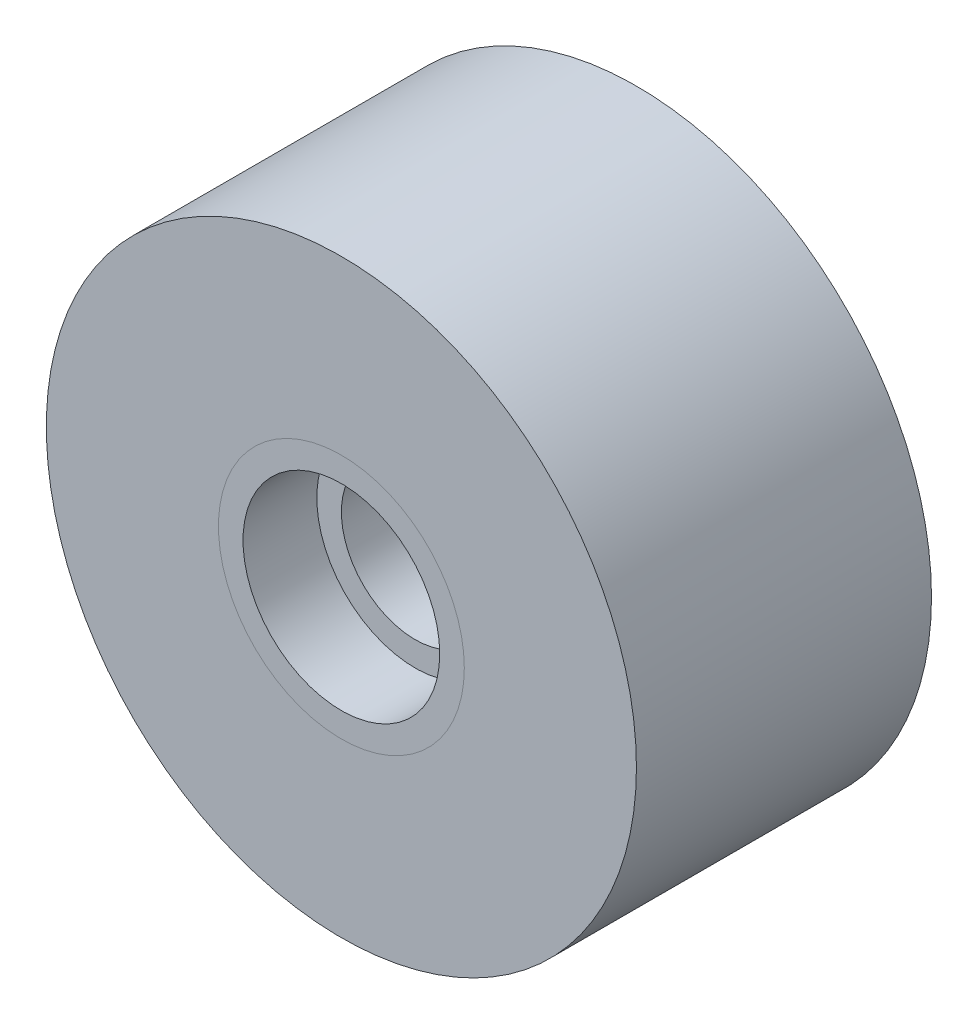
ISO-10303-21;
HEADER;
FILE_DESCRIPTION(('STEP AP214'),'2;1');
FILE_NAME('part.step','',(''),(''),'','','');
FILE_SCHEMA(('AUTOMOTIVE_DESIGN { 1 0 10303 214 1 1 1 1 }'));
ENDSEC;
DATA;
#1=APPLICATION_CONTEXT('core data for automotive mechanical design processes');
#2=APPLICATION_PROTOCOL_DEFINITION('international standard','automotive_design',2000,#1);
#3=PRODUCT_CONTEXT('',#1,'mechanical');
#4=PRODUCT('Part','Part','',(#3));
#5=PRODUCT_RELATED_PRODUCT_CATEGORY('part','',(#4));
#6=PRODUCT_DEFINITION_FORMATION('','',#4);
#7=PRODUCT_DEFINITION_CONTEXT('part definition',#1,'design');
#8=PRODUCT_DEFINITION('design','',#6,#7);
#9=PRODUCT_DEFINITION_SHAPE('','',#8);
#10=(LENGTH_UNIT() NAMED_UNIT(*) SI_UNIT(.MILLI.,.METRE.));
#11=(NAMED_UNIT(*) PLANE_ANGLE_UNIT() SI_UNIT($,.RADIAN.));
#12=(NAMED_UNIT(*) SI_UNIT($,.STERADIAN.) SOLID_ANGLE_UNIT());
#13=UNCERTAINTY_MEASURE_WITH_UNIT(LENGTH_MEASURE(1.E-05),#10,'distance_accuracy_value','');
#14=(GEOMETRIC_REPRESENTATION_CONTEXT(3) GLOBAL_UNCERTAINTY_ASSIGNED_CONTEXT((#13)) GLOBAL_UNIT_ASSIGNED_CONTEXT((#10,
#11,#12)) REPRESENTATION_CONTEXT('',''));
#15=CARTESIAN_POINT('',(0.,0.,0.));
#16=DIRECTION('',(0.,0.,1.));
#17=DIRECTION('',(1.,0.,0.));
#18=AXIS2_PLACEMENT_3D('',#15,#16,#17);
#19=CARTESIAN_POINT('',(0.,0.,6.));
#20=DIRECTION('',(0.,0.,-1.));
#21=DIRECTION('',(-1.,0.,0.));
#22=AXIS2_PLACEMENT_3D('',#19,#20,#21);
#23=CYLINDRICAL_SURFACE('',#22,4.);
#24=CARTESIAN_POINT('',(0.,0.,-6.));
#25=DIRECTION('',(0.,0.,1.));
#26=DIRECTION('',(1.,0.,0.));
#27=AXIS2_PLACEMENT_3D('',#24,#25,#26);
#28=CIRCLE('',#27,4.);
#29=CARTESIAN_POINT('',(4.,0.,-6.));
#30=VERTEX_POINT('',#29);
#31=EDGE_CURVE('E64',#30,#30,#28,.T.);
#32=ORIENTED_EDGE('',*,*,#31,.F.);
#33=EDGE_LOOP('',(#32));
#34=FACE_BOUND('',#33,.T.);
#35=CARTESIAN_POINT('',(0.,0.,-3.));
#36=DIRECTION('',(0.,0.,1.));
#37=DIRECTION('',(1.,0.,0.));
#38=AXIS2_PLACEMENT_3D('',#35,#36,#37);
#39=CIRCLE('',#38,4.);
#40=CARTESIAN_POINT('',(4.,0.,-3.));
#41=VERTEX_POINT('',#40);
#42=EDGE_CURVE('E97',#41,#41,#39,.T.);
#43=ORIENTED_EDGE('',*,*,#42,.T.);
#44=EDGE_LOOP('',(#43));
#45=FACE_BOUND('',#44,.T.);
#46=ADVANCED_FACE('F44',(#34,#45),#23,.F.);
#47=CARTESIAN_POINT('',(0.,0.,3.));
#48=DIRECTION('',(0.,0.,1.));
#49=DIRECTION('',(1.,0.,0.));
#50=AXIS2_PLACEMENT_3D('',#47,#48,#49);
#51=CIRCLE('',#50,4.);
#52=CARTESIAN_POINT('',(4.,0.,3.));
#53=VERTEX_POINT('',#52);
#54=EDGE_CURVE('E11',#53,#53,#51,.T.);
#55=ORIENTED_EDGE('',*,*,#54,.F.);
#56=EDGE_LOOP('',(#55));
#57=FACE_BOUND('',#56,.T.);
#58=CARTESIAN_POINT('',(0.,0.,6.));
#59=DIRECTION('',(0.,0.,1.));
#60=DIRECTION('',(1.,0.,0.));
#61=AXIS2_PLACEMENT_3D('',#58,#59,#60);
#62=CIRCLE('',#61,4.);
#63=CARTESIAN_POINT('',(4.,0.,6.));
#64=VERTEX_POINT('',#63);
#65=EDGE_CURVE('E55',#64,#64,#62,.T.);
#66=ORIENTED_EDGE('',*,*,#65,.T.);
#67=EDGE_LOOP('',(#66));
#68=FACE_BOUND('',#67,.T.);
#69=ADVANCED_FACE('F46',(#57,#68),#23,.F.);
#70=CARTESIAN_POINT('',(0.,0.,6.));
#71=DIRECTION('',(0.,0.,-1.));
#72=DIRECTION('',(-1.,0.,0.));
#73=AXIS2_PLACEMENT_3D('',#70,#71,#72);
#74=CYLINDRICAL_SURFACE('',#73,5.);
#75=CARTESIAN_POINT('',(0.,0.,6.));
#76=DIRECTION('',(0.,0.,1.));
#77=DIRECTION('',(1.,0.,0.));
#78=AXIS2_PLACEMENT_3D('',#75,#76,#77);
#79=CIRCLE('',#78,5.);
#80=CARTESIAN_POINT('',(5.,0.,6.));
#81=VERTEX_POINT('',#80);
#82=EDGE_CURVE('E51',#81,#81,#79,.T.);
#83=ORIENTED_EDGE('',*,*,#82,.F.);
#84=EDGE_LOOP('',(#83));
#85=FACE_BOUND('',#84,.T.);
#86=CARTESIAN_POINT('',(0.,0.,-6.));
#87=DIRECTION('',(0.,0.,1.));
#88=DIRECTION('',(1.,0.,0.));
#89=AXIS2_PLACEMENT_3D('',#86,#87,#88);
#90=CIRCLE('',#89,5.);
#91=CARTESIAN_POINT('',(5.,0.,-6.));
#92=VERTEX_POINT('',#91);
#93=EDGE_CURVE('E60',#92,#92,#90,.T.);
#94=ORIENTED_EDGE('',*,*,#93,.T.);
#95=EDGE_LOOP('',(#94));
#96=FACE_BOUND('',#95,.T.);
#97=ADVANCED_FACE('F70',(#85,#96),#74,.T.);
#98=CARTESIAN_POINT('',(0.,0.,6.));
#99=DIRECTION('',(0.,0.,1.));
#100=DIRECTION('',(1.,0.,0.));
#101=AXIS2_PLACEMENT_3D('',#98,#99,#100);
#102=PLANE('',#101);
#103=ORIENTED_EDGE('',*,*,#65,.F.);
#104=EDGE_LOOP('',(#103));
#105=FACE_BOUND('',#104,.T.);
#106=ORIENTED_EDGE('',*,*,#82,.T.);
#107=EDGE_LOOP('',(#106));
#108=FACE_BOUND('',#107,.T.);
#109=ADVANCED_FACE('F75',(#105,#108),#102,.T.);
#110=CARTESIAN_POINT('',(0.,0.,-6.));
#111=DIRECTION('',(0.,0.,1.));
#112=DIRECTION('',(1.,0.,0.));
#113=AXIS2_PLACEMENT_3D('',#110,#111,#112);
#114=PLANE('',#113);
#115=ORIENTED_EDGE('',*,*,#31,.T.);
#116=EDGE_LOOP('',(#115));
#117=FACE_BOUND('',#116,.T.);
#118=ORIENTED_EDGE('',*,*,#93,.F.);
#119=EDGE_LOOP('',(#118));
#120=FACE_BOUND('',#119,.T.);
#121=ADVANCED_FACE('F72',(#117,#120),#114,.F.);
#122=CARTESIAN_POINT('',(0.,0.,3.));
#123=DIRECTION('',(0.,0.,-1.));
#124=DIRECTION('',(-1.,0.,0.));
#125=AXIS2_PLACEMENT_3D('',#122,#123,#124);
#126=CYLINDRICAL_SURFACE('',#125,3.);
#127=CARTESIAN_POINT('',(0.,0.,3.));
#128=DIRECTION('',(0.,0.,1.));
#129=DIRECTION('',(1.,0.,0.));
#130=AXIS2_PLACEMENT_3D('',#127,#128,#129);
#131=CIRCLE('',#130,3.);
#132=CARTESIAN_POINT('',(3.,0.,3.));
#133=VERTEX_POINT('',#132);
#134=EDGE_CURVE('E66',#133,#133,#131,.T.);
#135=ORIENTED_EDGE('',*,*,#134,.T.);
#136=EDGE_LOOP('',(#135));
#137=FACE_BOUND('',#136,.T.);
#138=CARTESIAN_POINT('',(0.,0.,-3.));
#139=DIRECTION('',(0.,0.,1.));
#140=DIRECTION('',(1.,0.,0.));
#141=AXIS2_PLACEMENT_3D('',#138,#139,#140);
#142=CIRCLE('',#141,3.);
#143=CARTESIAN_POINT('',(3.,0.,-3.));
#144=VERTEX_POINT('',#143);
#145=EDGE_CURVE('E99',#144,#144,#142,.T.);
#146=ORIENTED_EDGE('',*,*,#145,.F.);
#147=EDGE_LOOP('',(#146));
#148=FACE_BOUND('',#147,.T.);
#149=ADVANCED_FACE('F74',(#137,#148),#126,.F.);
#150=CARTESIAN_POINT('',(0.,0.,3.));
#151=DIRECTION('',(0.,0.,1.));
#152=DIRECTION('',(1.,0.,0.));
#153=AXIS2_PLACEMENT_3D('',#150,#151,#152);
#154=PLANE('',#153);
#155=ORIENTED_EDGE('',*,*,#134,.F.);
#156=EDGE_LOOP('',(#155));
#157=FACE_BOUND('',#156,.T.);
#158=ORIENTED_EDGE('',*,*,#54,.T.);
#159=EDGE_LOOP('',(#158));
#160=FACE_BOUND('',#159,.T.);
#161=ADVANCED_FACE('F82',(#157,#160),#154,.T.);
#162=CARTESIAN_POINT('',(0.,0.,-3.));
#163=DIRECTION('',(0.,0.,1.));
#164=DIRECTION('',(1.,0.,0.));
#165=AXIS2_PLACEMENT_3D('',#162,#163,#164);
#166=PLANE('',#165);
#167=ORIENTED_EDGE('',*,*,#145,.T.);
#168=EDGE_LOOP('',(#167));
#169=FACE_BOUND('',#168,.T.);
#170=ORIENTED_EDGE('',*,*,#42,.F.);
#171=EDGE_LOOP('',(#170));
#172=FACE_BOUND('',#171,.T.);
#173=ADVANCED_FACE('F106',(#169,#172),#166,.F.);
#174=CLOSED_SHELL('',(#46,#69,#97,#109,#121,#149,#161,#173));
#175=MANIFOLD_SOLID_BREP('B2',#174);
#176=CARTESIAN_POINT('',(0.,0.,6.));
#177=DIRECTION('',(0.,0.,-1.));
#178=DIRECTION('',(-1.,0.,0.));
#179=AXIS2_PLACEMENT_3D('',#176,#177,#178);
#180=CYLINDRICAL_SURFACE('',#179,5.);
#181=CARTESIAN_POINT('',(0.,0.,6.));
#182=DIRECTION('',(0.,0.,1.));
#183=DIRECTION('',(1.,0.,0.));
#184=AXIS2_PLACEMENT_3D('',#181,#182,#183);
#185=CIRCLE('',#184,5.);
#186=CARTESIAN_POINT('',(5.,0.,6.));
#187=VERTEX_POINT('',#186);
#188=EDGE_CURVE('E171',#187,#187,#185,.T.);
#189=ORIENTED_EDGE('',*,*,#188,.T.);
#190=EDGE_LOOP('',(#189));
#191=FACE_BOUND('',#190,.T.);
#192=CARTESIAN_POINT('',(0.,0.,-6.));
#193=DIRECTION('',(0.,0.,1.));
#194=DIRECTION('',(1.,0.,0.));
#195=AXIS2_PLACEMENT_3D('',#192,#193,#194);
#196=CIRCLE('',#195,5.);
#197=CARTESIAN_POINT('',(5.,0.,-6.));
#198=VERTEX_POINT('',#197);
#199=EDGE_CURVE('E177',#198,#198,#196,.T.);
#200=ORIENTED_EDGE('',*,*,#199,.F.);
#201=EDGE_LOOP('',(#200));
#202=FACE_BOUND('',#201,.T.);
#203=ADVANCED_FACE('F164',(#191,#202),#180,.F.);
#204=CARTESIAN_POINT('',(0.,0.,6.));
#205=DIRECTION('',(0.,0.,-1.));
#206=DIRECTION('',(-1.,0.,0.));
#207=AXIS2_PLACEMENT_3D('',#204,#205,#206);
#208=CYLINDRICAL_SURFACE('',#207,12.);
#209=CARTESIAN_POINT('',(0.,0.,6.));
#210=DIRECTION('',(0.,0.,1.));
#211=DIRECTION('',(1.,0.,0.));
#212=AXIS2_PLACEMENT_3D('',#209,#210,#211);
#213=CIRCLE('',#212,12.);
#214=CARTESIAN_POINT('',(12.,0.,6.));
#215=VERTEX_POINT('',#214);
#216=EDGE_CURVE('E43',#215,#215,#213,.T.);
#217=ORIENTED_EDGE('',*,*,#216,.F.);
#218=EDGE_LOOP('',(#217));
#219=FACE_BOUND('',#218,.T.);
#220=CARTESIAN_POINT('',(0.,0.,-6.));
#221=DIRECTION('',(0.,0.,1.));
#222=DIRECTION('',(1.,0.,0.));
#223=AXIS2_PLACEMENT_3D('',#220,#221,#222);
#224=CIRCLE('',#223,12.);
#225=CARTESIAN_POINT('',(12.,0.,-6.));
#226=VERTEX_POINT('',#225);
#227=EDGE_CURVE('E167',#226,#226,#224,.T.);
#228=ORIENTED_EDGE('',*,*,#227,.T.);
#229=EDGE_LOOP('',(#228));
#230=FACE_BOUND('',#229,.T.);
#231=ADVANCED_FACE('F184',(#219,#230),#208,.T.);
#232=CARTESIAN_POINT('',(0.,0.,6.));
#233=DIRECTION('',(0.,0.,1.));
#234=DIRECTION('',(1.,0.,0.));
#235=AXIS2_PLACEMENT_3D('',#232,#233,#234);
#236=PLANE('',#235);
#237=ORIENTED_EDGE('',*,*,#188,.F.);
#238=EDGE_LOOP('',(#237));
#239=FACE_BOUND('',#238,.T.);
#240=ORIENTED_EDGE('',*,*,#216,.T.);
#241=EDGE_LOOP('',(#240));
#242=FACE_BOUND('',#241,.T.);
#243=ADVANCED_FACE('F188',(#239,#242),#236,.T.);
#244=CARTESIAN_POINT('',(0.,0.,-6.));
#245=DIRECTION('',(0.,0.,1.));
#246=DIRECTION('',(1.,0.,0.));
#247=AXIS2_PLACEMENT_3D('',#244,#245,#246);
#248=PLANE('',#247);
#249=ORIENTED_EDGE('',*,*,#199,.T.);
#250=EDGE_LOOP('',(#249));
#251=FACE_BOUND('',#250,.T.);
#252=ORIENTED_EDGE('',*,*,#227,.F.);
#253=EDGE_LOOP('',(#252));
#254=FACE_BOUND('',#253,.T.);
#255=ADVANCED_FACE('F186',(#251,#254),#248,.F.);
#256=CLOSED_SHELL('',(#203,#231,#243,#255));
#257=MANIFOLD_SOLID_BREP('B6',#256);
#258=ADVANCED_BREP_SHAPE_REPRESENTATION('',(#18,#175,#257),#14);
#259=SHAPE_DEFINITION_REPRESENTATION(#9,#258);
ENDSEC;
END-ISO-10303-21;
